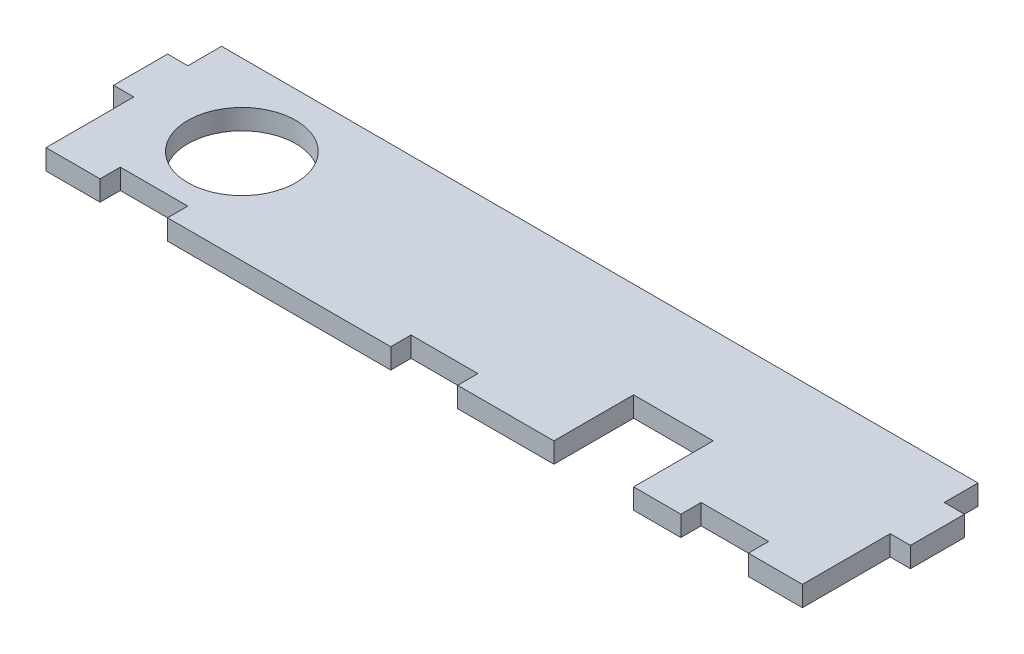
ISO-10303-21;
HEADER;
FILE_DESCRIPTION(('STEP AP214'),'2;1');
FILE_NAME('part.step','',(''),(''),'','','');
FILE_SCHEMA(('AUTOMOTIVE_DESIGN { 1 0 10303 214 1 1 1 1 }'));
ENDSEC;
DATA;
#1=APPLICATION_CONTEXT('core data for automotive mechanical design processes');
#2=APPLICATION_PROTOCOL_DEFINITION('international standard','automotive_design',2000,#1);
#3=PRODUCT_CONTEXT('',#1,'mechanical');
#4=PRODUCT('Part','Part','',(#3));
#5=PRODUCT_RELATED_PRODUCT_CATEGORY('part','',(#4));
#6=PRODUCT_DEFINITION_FORMATION('','',#4);
#7=PRODUCT_DEFINITION_CONTEXT('part definition',#1,'design');
#8=PRODUCT_DEFINITION('design','',#6,#7);
#9=PRODUCT_DEFINITION_SHAPE('','',#8);
#10=(LENGTH_UNIT() NAMED_UNIT(*) SI_UNIT(.MILLI.,.METRE.));
#11=(NAMED_UNIT(*) PLANE_ANGLE_UNIT() SI_UNIT($,.RADIAN.));
#12=(NAMED_UNIT(*) SI_UNIT($,.STERADIAN.) SOLID_ANGLE_UNIT());
#13=UNCERTAINTY_MEASURE_WITH_UNIT(LENGTH_MEASURE(1.E-05),#10,'distance_accuracy_value','');
#14=(GEOMETRIC_REPRESENTATION_CONTEXT(3) GLOBAL_UNCERTAINTY_ASSIGNED_CONTEXT((#13)) GLOBAL_UNIT_ASSIGNED_CONTEXT((#10,
#11,#12)) REPRESENTATION_CONTEXT('',''));
#15=CARTESIAN_POINT('',(0.,0.,0.));
#16=DIRECTION('',(0.,0.,1.));
#17=DIRECTION('',(1.,0.,0.));
#18=AXIS2_PLACEMENT_3D('',#15,#16,#17);
#19=CARTESIAN_POINT('',(0.,3.,0.));
#20=DIRECTION('',(0.,1.,0.));
#21=DIRECTION('',(0.,0.,1.));
#22=AXIS2_PLACEMENT_3D('',#19,#20,#21);
#23=PLANE('',#22);
#24=DIRECTION('',(1.,0.,0.));
#25=VECTOR('',#24,1.);
#26=CARTESIAN_POINT('',(1119.40812578582,3.,2442.39366866363));
#27=LINE('',#26,#25);
#28=CARTESIAN_POINT('',(1109.40812578582,3.,2442.39366866363));
#29=VERTEX_POINT('',#28);
#30=CARTESIAN_POINT('',(1119.40812578582,3.,2442.39366866363));
#31=VERTEX_POINT('',#30);
#32=EDGE_CURVE('E304',#29,#31,#27,.T.);
#33=ORIENTED_EDGE('',*,*,#32,.T.);
#34=DIRECTION('',(0.,0.,1.));
#35=VECTOR('',#34,1.);
#36=CARTESIAN_POINT('',(1119.40812578582,3.,2445.39366866363));
#37=LINE('',#36,#35);
#38=CARTESIAN_POINT('',(1119.40812578582,3.,2445.39366866363));
#39=VERTEX_POINT('',#38);
#40=EDGE_CURVE('E152',#31,#39,#37,.T.);
#41=ORIENTED_EDGE('',*,*,#40,.T.);
#42=DIRECTION('',(1.,0.,0.));
#43=VECTOR('',#42,1.);
#44=CARTESIAN_POINT('',(1119.40812578582,3.,2445.39366866363));
#45=LINE('',#44,#43);
#46=CARTESIAN_POINT('',(1152.45812578582,3.,2445.39366866363));
#47=VERTEX_POINT('',#46);
#48=EDGE_CURVE('E379',#39,#47,#45,.T.);
#49=ORIENTED_EDGE('',*,*,#48,.T.);
#50=DIRECTION('',(0.,0.,-1.));
#51=VECTOR('',#50,1.);
#52=CARTESIAN_POINT('',(1152.45812578582,3.,2445.39366866363));
#53=LINE('',#52,#51);
#54=CARTESIAN_POINT('',(1152.45812578582,3.,2442.39366866363));
#55=VERTEX_POINT('',#54);
#56=EDGE_CURVE('E398',#47,#55,#53,.T.);
#57=ORIENTED_EDGE('',*,*,#56,.T.);
#58=DIRECTION('',(1.,0.,0.));
#59=VECTOR('',#58,1.);
#60=CARTESIAN_POINT('',(1152.45812578582,3.,2442.39366866363));
#61=LINE('',#60,#59);
#62=CARTESIAN_POINT('',(1162.35812578582,3.,2442.39366866363));
#63=VERTEX_POINT('',#62);
#64=EDGE_CURVE('E395',#55,#63,#61,.T.);
#65=ORIENTED_EDGE('',*,*,#64,.T.);
#66=DIRECTION('',(0.,0.,1.));
#67=VECTOR('',#66,1.);
#68=CARTESIAN_POINT('',(1162.35812578582,3.,2442.39366866363));
#69=LINE('',#68,#67);
#70=CARTESIAN_POINT('',(1162.35812578582,3.,2445.39366866363));
#71=VERTEX_POINT('',#70);
#72=EDGE_CURVE('E397',#63,#71,#69,.T.);
#73=ORIENTED_EDGE('',*,*,#72,.T.);
#74=DIRECTION('',(1.,0.,0.));
#75=VECTOR('',#74,1.);
#76=CARTESIAN_POINT('',(1162.35812578582,3.,2445.39366866363));
#77=LINE('',#76,#75);
#78=CARTESIAN_POINT('',(1176.60812578582,3.,2445.39366866363));
#79=VERTEX_POINT('',#78);
#80=EDGE_CURVE('E400',#71,#79,#77,.T.);
#81=ORIENTED_EDGE('',*,*,#80,.T.);
#82=DIRECTION('',(0.,0.,-1.));
#83=VECTOR('',#82,1.);
#84=CARTESIAN_POINT('',(1176.60812578582,3.,2433.59366866363));
#85=LINE('',#84,#83);
#86=CARTESIAN_POINT('',(1176.60812578582,3.,2433.59366866363));
#87=VERTEX_POINT('',#86);
#88=EDGE_CURVE('E406',#79,#87,#85,.T.);
#89=ORIENTED_EDGE('',*,*,#88,.T.);
#90=DIRECTION('',(1.,0.,0.));
#91=VECTOR('',#90,1.);
#92=CARTESIAN_POINT('',(1176.60812578582,3.,2433.59366866363));
#93=LINE('',#92,#91);
#94=CARTESIAN_POINT('',(1188.40812578582,3.,2433.59366866363));
#95=VERTEX_POINT('',#94);
#96=EDGE_CURVE('E408',#87,#95,#93,.T.);
#97=ORIENTED_EDGE('',*,*,#96,.T.);
#98=DIRECTION('',(0.,0.,1.));
#99=VECTOR('',#98,1.);
#100=CARTESIAN_POINT('',(1188.40812578582,3.,2433.59366866363));
#101=LINE('',#100,#99);
#102=CARTESIAN_POINT('',(1188.40812578582,3.,2445.39366866363));
#103=VERTEX_POINT('',#102);
#104=EDGE_CURVE('E410',#95,#103,#101,.T.);
#105=ORIENTED_EDGE('',*,*,#104,.T.);
#106=DIRECTION('',(1.,0.,0.));
#107=VECTOR('',#106,1.);
#108=CARTESIAN_POINT('',(1188.40812578582,3.,2445.39366866363));
#109=LINE('',#108,#107);
#110=CARTESIAN_POINT('',(1195.40812578582,3.,2445.39366866363));
#111=VERTEX_POINT('',#110);
#112=EDGE_CURVE('E412',#103,#111,#109,.T.);
#113=ORIENTED_EDGE('',*,*,#112,.T.);
#114=DIRECTION('',(0.,0.,-1.));
#115=VECTOR('',#114,1.);
#116=CARTESIAN_POINT('',(1195.40812578582,3.,2445.39366866363));
#117=LINE('',#116,#115);
#118=CARTESIAN_POINT('',(1195.40812578582,3.,2442.39366866363));
#119=VERTEX_POINT('',#118);
#120=EDGE_CURVE('E414',#111,#119,#117,.T.);
#121=ORIENTED_EDGE('',*,*,#120,.T.);
#122=DIRECTION('',(1.,0.,0.));
#123=VECTOR('',#122,1.);
#124=CARTESIAN_POINT('',(1195.40812578582,3.,2442.39366866363));
#125=LINE('',#124,#123);
#126=CARTESIAN_POINT('',(1205.40812578582,3.,2442.39366866363));
#127=VERTEX_POINT('',#126);
#128=EDGE_CURVE('E416',#119,#127,#125,.T.);
#129=ORIENTED_EDGE('',*,*,#128,.T.);
#130=DIRECTION('',(0.,0.,1.));
#131=VECTOR('',#130,1.);
#132=CARTESIAN_POINT('',(1205.40812578582,3.,2442.39366866363));
#133=LINE('',#132,#131);
#134=CARTESIAN_POINT('',(1205.40812578582,3.,2445.39366866363));
#135=VERTEX_POINT('',#134);
#136=EDGE_CURVE('E418',#127,#135,#133,.T.);
#137=ORIENTED_EDGE('',*,*,#136,.T.);
#138=DIRECTION('',(1.,0.,0.));
#139=VECTOR('',#138,1.);
#140=CARTESIAN_POINT('',(1205.40812578582,3.,2445.39366866363));
#141=LINE('',#140,#139);
#142=CARTESIAN_POINT('',(1213.40812578582,3.,2445.39366866363));
#143=VERTEX_POINT('',#142);
#144=EDGE_CURVE('E420',#135,#143,#141,.T.);
#145=ORIENTED_EDGE('',*,*,#144,.T.);
#146=DIRECTION('',(0.,0.,-1.));
#147=VECTOR('',#146,1.);
#148=CARTESIAN_POINT('',(1213.40812578582,3.,2432.39366866363));
#149=LINE('',#148,#147);
#150=CARTESIAN_POINT('',(1213.40812578582,3.,2432.39366866363));
#151=VERTEX_POINT('',#150);
#152=EDGE_CURVE('E422',#143,#151,#149,.T.);
#153=ORIENTED_EDGE('',*,*,#152,.T.);
#154=DIRECTION('',(1.,0.,0.));
#155=VECTOR('',#154,1.);
#156=CARTESIAN_POINT('',(1213.40812578582,3.,2432.39366866363));
#157=LINE('',#156,#155);
#158=CARTESIAN_POINT('',(1216.40812578582,3.,2432.39366866363));
#159=VERTEX_POINT('',#158);
#160=EDGE_CURVE('E424',#151,#159,#157,.T.);
#161=ORIENTED_EDGE('',*,*,#160,.T.);
#162=DIRECTION('',(0.,0.,-1.));
#163=VECTOR('',#162,1.);
#164=CARTESIAN_POINT('',(1216.40812578582,3.,2432.39366866363));
#165=LINE('',#164,#163);
#166=CARTESIAN_POINT('',(1216.40812578582,3.,2424.39366866363));
#167=VERTEX_POINT('',#166);
#168=EDGE_CURVE('E426',#159,#167,#165,.T.);
#169=ORIENTED_EDGE('',*,*,#168,.T.);
#170=DIRECTION('',(-1.,0.,0.));
#171=VECTOR('',#170,1.);
#172=CARTESIAN_POINT('',(1216.40812578582,3.,2424.39366866363));
#173=LINE('',#172,#171);
#174=CARTESIAN_POINT('',(1213.40812578582,3.,2424.39366866363));
#175=VERTEX_POINT('',#174);
#176=EDGE_CURVE('E428',#167,#175,#173,.T.);
#177=ORIENTED_EDGE('',*,*,#176,.T.);
#178=DIRECTION('',(0.,0.,-1.));
#179=VECTOR('',#178,1.);
#180=CARTESIAN_POINT('',(1213.40812578582,3.,2419.39366866363));
#181=LINE('',#180,#179);
#182=CARTESIAN_POINT('',(1213.40812578582,3.,2419.39366866363));
#183=VERTEX_POINT('',#182);
#184=EDGE_CURVE('E430',#175,#183,#181,.T.);
#185=ORIENTED_EDGE('',*,*,#184,.T.);
#186=DIRECTION('',(-1.,0.,0.));
#187=VECTOR('',#186,1.);
#188=CARTESIAN_POINT('',(1101.40812578582,3.,2419.39366866363));
#189=LINE('',#188,#187);
#190=CARTESIAN_POINT('',(1101.40812578582,3.,2419.39366866363));
#191=VERTEX_POINT('',#190);
#192=EDGE_CURVE('E432',#183,#191,#189,.T.);
#193=ORIENTED_EDGE('',*,*,#192,.T.);
#194=DIRECTION('',(0.,0.,1.));
#195=VECTOR('',#194,1.);
#196=CARTESIAN_POINT('',(1101.40812578582,3.,2419.39366866363));
#197=LINE('',#196,#195);
#198=CARTESIAN_POINT('',(1101.40812578582,3.,2424.39366866363));
#199=VERTEX_POINT('',#198);
#200=EDGE_CURVE('E434',#191,#199,#197,.T.);
#201=ORIENTED_EDGE('',*,*,#200,.T.);
#202=DIRECTION('',(-1.,0.,0.));
#203=VECTOR('',#202,1.);
#204=CARTESIAN_POINT('',(1098.40812578582,3.,2424.39366866363));
#205=LINE('',#204,#203);
#206=CARTESIAN_POINT('',(1098.40812578582,3.,2424.39366866363));
#207=VERTEX_POINT('',#206);
#208=EDGE_CURVE('E436',#199,#207,#205,.T.);
#209=ORIENTED_EDGE('',*,*,#208,.T.);
#210=DIRECTION('',(0.,0.,1.));
#211=VECTOR('',#210,1.);
#212=CARTESIAN_POINT('',(1098.40812578582,3.,2432.39366866363));
#213=LINE('',#212,#211);
#214=CARTESIAN_POINT('',(1098.40812578582,3.,2432.39366866363));
#215=VERTEX_POINT('',#214);
#216=EDGE_CURVE('E438',#207,#215,#213,.T.);
#217=ORIENTED_EDGE('',*,*,#216,.T.);
#218=DIRECTION('',(1.,0.,0.));
#219=VECTOR('',#218,1.);
#220=CARTESIAN_POINT('',(1101.40812578582,3.,2432.39366866363));
#221=LINE('',#220,#219);
#222=CARTESIAN_POINT('',(1101.40812578582,3.,2432.39366866363));
#223=VERTEX_POINT('',#222);
#224=EDGE_CURVE('E231',#215,#223,#221,.T.);
#225=ORIENTED_EDGE('',*,*,#224,.T.);
#226=DIRECTION('',(0.,0.,1.));
#227=VECTOR('',#226,1.);
#228=CARTESIAN_POINT('',(1101.40812578582,3.,2432.39366866363));
#229=LINE('',#228,#227);
#230=CARTESIAN_POINT('',(1101.40812578582,3.,2445.39366866363));
#231=VERTEX_POINT('',#230);
#232=EDGE_CURVE('E225',#223,#231,#229,.T.);
#233=ORIENTED_EDGE('',*,*,#232,.T.);
#234=DIRECTION('',(1.,0.,0.));
#235=VECTOR('',#234,1.);
#236=CARTESIAN_POINT('',(1109.40812578582,3.,2445.39366866363));
#237=LINE('',#236,#235);
#238=CARTESIAN_POINT('',(1109.40812578582,3.,2445.39366866363));
#239=VERTEX_POINT('',#238);
#240=EDGE_CURVE('E229',#231,#239,#237,.T.);
#241=ORIENTED_EDGE('',*,*,#240,.T.);
#242=DIRECTION('',(0.,0.,-1.));
#243=VECTOR('',#242,1.);
#244=CARTESIAN_POINT('',(1109.40812578582,3.,2442.39366866363));
#245=LINE('',#244,#243);
#246=EDGE_CURVE('E49',#239,#29,#245,.T.);
#247=ORIENTED_EDGE('',*,*,#246,.T.);
#248=EDGE_LOOP('',(#33,#41,#49,#57,#65,#73,#81,#89,#97,#105,#113,#121,#129,#137,#145,#153,#161,
#169,#177,#185,#193,#201,#209,#217,#225,#233,#241,#247));
#249=FACE_BOUND('',#248,.T.);
#250=CARTESIAN_POINT('',(1116.40812578582,3.,2431.39366866363));
#251=DIRECTION('',(0.,1.,0.));
#252=DIRECTION('',(0.,0.,1.));
#253=AXIS2_PLACEMENT_3D('',#250,#251,#252);
#254=CIRCLE('',#253,7.99999999999999);
#255=CARTESIAN_POINT('',(1116.40812578582,3.,2439.39366866363));
#256=VERTEX_POINT('',#255);
#257=EDGE_CURVE('E253',#256,#256,#254,.T.);
#258=ORIENTED_EDGE('',*,*,#257,.F.);
#259=EDGE_LOOP('',(#258));
#260=FACE_BOUND('',#259,.T.);
#261=ADVANCED_FACE('F32',(#249,#260),#23,.T.);
#262=CARTESIAN_POINT('',(0.,0.,0.));
#263=DIRECTION('',(0.,1.,0.));
#264=DIRECTION('',(0.,0.,1.));
#265=AXIS2_PLACEMENT_3D('',#262,#263,#264);
#266=PLANE('',#265);
#267=DIRECTION('',(1.,0.,0.));
#268=VECTOR('',#267,1.);
#269=CARTESIAN_POINT('',(1119.40812578582,0.,2442.39366866363));
#270=LINE('',#269,#268);
#271=CARTESIAN_POINT('',(1109.40812578582,0.,2442.39366866363));
#272=VERTEX_POINT('',#271);
#273=CARTESIAN_POINT('',(1119.40812578582,0.,2442.39366866363));
#274=VERTEX_POINT('',#273);
#275=EDGE_CURVE('E249',#272,#274,#270,.T.);
#276=ORIENTED_EDGE('',*,*,#275,.F.);
#277=DIRECTION('',(0.,0.,-1.));
#278=VECTOR('',#277,1.);
#279=CARTESIAN_POINT('',(1109.40812578582,0.,2442.39366866363));
#280=LINE('',#279,#278);
#281=CARTESIAN_POINT('',(1109.40812578582,0.,2445.39366866363));
#282=VERTEX_POINT('',#281);
#283=EDGE_CURVE('E144',#282,#272,#280,.T.);
#284=ORIENTED_EDGE('',*,*,#283,.F.);
#285=DIRECTION('',(1.,0.,0.));
#286=VECTOR('',#285,1.);
#287=CARTESIAN_POINT('',(1109.40812578582,0.,2445.39366866363));
#288=LINE('',#287,#286);
#289=CARTESIAN_POINT('',(1101.40812578582,0.,2445.39366866363));
#290=VERTEX_POINT('',#289);
#291=EDGE_CURVE('E138',#290,#282,#288,.T.);
#292=ORIENTED_EDGE('',*,*,#291,.F.);
#293=DIRECTION('',(0.,0.,1.));
#294=VECTOR('',#293,1.);
#295=CARTESIAN_POINT('',(1101.40812578582,0.,2432.39366866363));
#296=LINE('',#295,#294);
#297=CARTESIAN_POINT('',(1101.40812578582,0.,2432.39366866363));
#298=VERTEX_POINT('',#297);
#299=EDGE_CURVE('E239',#298,#290,#296,.T.);
#300=ORIENTED_EDGE('',*,*,#299,.F.);
#301=DIRECTION('',(1.,0.,0.));
#302=VECTOR('',#301,1.);
#303=CARTESIAN_POINT('',(1101.40812578582,0.,2432.39366866363));
#304=LINE('',#303,#302);
#305=CARTESIAN_POINT('',(1098.40812578582,0.,2432.39366866363));
#306=VERTEX_POINT('',#305);
#307=EDGE_CURVE('E299',#306,#298,#304,.T.);
#308=ORIENTED_EDGE('',*,*,#307,.F.);
#309=DIRECTION('',(0.,0.,1.));
#310=VECTOR('',#309,1.);
#311=CARTESIAN_POINT('',(1098.40812578582,0.,2432.39366866363));
#312=LINE('',#311,#310);
#313=CARTESIAN_POINT('',(1098.40812578582,0.,2424.39366866363));
#314=VERTEX_POINT('',#313);
#315=EDGE_CURVE('E297',#314,#306,#312,.T.);
#316=ORIENTED_EDGE('',*,*,#315,.F.);
#317=DIRECTION('',(-1.,0.,0.));
#318=VECTOR('',#317,1.);
#319=CARTESIAN_POINT('',(1098.40812578582,0.,2424.39366866363));
#320=LINE('',#319,#318);
#321=CARTESIAN_POINT('',(1101.40812578582,0.,2424.39366866363));
#322=VERTEX_POINT('',#321);
#323=EDGE_CURVE('E295',#322,#314,#320,.T.);
#324=ORIENTED_EDGE('',*,*,#323,.F.);
#325=DIRECTION('',(0.,0.,1.));
#326=VECTOR('',#325,1.);
#327=CARTESIAN_POINT('',(1101.40812578582,0.,2419.39366866363));
#328=LINE('',#327,#326);
#329=CARTESIAN_POINT('',(1101.40812578582,0.,2419.39366866363));
#330=VERTEX_POINT('',#329);
#331=EDGE_CURVE('E293',#330,#322,#328,.T.);
#332=ORIENTED_EDGE('',*,*,#331,.F.);
#333=DIRECTION('',(-1.,0.,0.));
#334=VECTOR('',#333,1.);
#335=CARTESIAN_POINT('',(1101.40812578582,0.,2419.39366866363));
#336=LINE('',#335,#334);
#337=CARTESIAN_POINT('',(1213.40812578582,0.,2419.39366866363));
#338=VERTEX_POINT('',#337);
#339=EDGE_CURVE('E291',#338,#330,#336,.T.);
#340=ORIENTED_EDGE('',*,*,#339,.F.);
#341=DIRECTION('',(0.,0.,-1.));
#342=VECTOR('',#341,1.);
#343=CARTESIAN_POINT('',(1213.40812578582,0.,2419.39366866363));
#344=LINE('',#343,#342);
#345=CARTESIAN_POINT('',(1213.40812578582,0.,2424.39366866363));
#346=VERTEX_POINT('',#345);
#347=EDGE_CURVE('E289',#346,#338,#344,.T.);
#348=ORIENTED_EDGE('',*,*,#347,.F.);
#349=DIRECTION('',(-1.,0.,0.));
#350=VECTOR('',#349,1.);
#351=CARTESIAN_POINT('',(1216.40812578582,0.,2424.39366866363));
#352=LINE('',#351,#350);
#353=CARTESIAN_POINT('',(1216.40812578582,0.,2424.39366866363));
#354=VERTEX_POINT('',#353);
#355=EDGE_CURVE('E287',#354,#346,#352,.T.);
#356=ORIENTED_EDGE('',*,*,#355,.F.);
#357=DIRECTION('',(0.,0.,-1.));
#358=VECTOR('',#357,1.);
#359=CARTESIAN_POINT('',(1216.40812578582,0.,2432.39366866363));
#360=LINE('',#359,#358);
#361=CARTESIAN_POINT('',(1216.40812578582,0.,2432.39366866363));
#362=VERTEX_POINT('',#361);
#363=EDGE_CURVE('E285',#362,#354,#360,.T.);
#364=ORIENTED_EDGE('',*,*,#363,.F.);
#365=DIRECTION('',(1.,0.,0.));
#366=VECTOR('',#365,1.);
#367=CARTESIAN_POINT('',(1213.40812578582,0.,2432.39366866363));
#368=LINE('',#367,#366);
#369=CARTESIAN_POINT('',(1213.40812578582,0.,2432.39366866363));
#370=VERTEX_POINT('',#369);
#371=EDGE_CURVE('E283',#370,#362,#368,.T.);
#372=ORIENTED_EDGE('',*,*,#371,.F.);
#373=DIRECTION('',(0.,0.,-1.));
#374=VECTOR('',#373,1.);
#375=CARTESIAN_POINT('',(1213.40812578582,0.,2432.39366866363));
#376=LINE('',#375,#374);
#377=CARTESIAN_POINT('',(1213.40812578582,0.,2445.39366866363));
#378=VERTEX_POINT('',#377);
#379=EDGE_CURVE('E281',#378,#370,#376,.T.);
#380=ORIENTED_EDGE('',*,*,#379,.F.);
#381=DIRECTION('',(1.,0.,0.));
#382=VECTOR('',#381,1.);
#383=CARTESIAN_POINT('',(1205.40812578582,0.,2445.39366866363));
#384=LINE('',#383,#382);
#385=CARTESIAN_POINT('',(1205.40812578582,0.,2445.39366866363));
#386=VERTEX_POINT('',#385);
#387=EDGE_CURVE('E279',#386,#378,#384,.T.);
#388=ORIENTED_EDGE('',*,*,#387,.F.);
#389=DIRECTION('',(0.,0.,1.));
#390=VECTOR('',#389,1.);
#391=CARTESIAN_POINT('',(1205.40812578582,0.,2442.39366866363));
#392=LINE('',#391,#390);
#393=CARTESIAN_POINT('',(1205.40812578582,0.,2442.39366866363));
#394=VERTEX_POINT('',#393);
#395=EDGE_CURVE('E277',#394,#386,#392,.T.);
#396=ORIENTED_EDGE('',*,*,#395,.F.);
#397=DIRECTION('',(1.,0.,0.));
#398=VECTOR('',#397,1.);
#399=CARTESIAN_POINT('',(1195.40812578582,0.,2442.39366866363));
#400=LINE('',#399,#398);
#401=CARTESIAN_POINT('',(1195.40812578582,0.,2442.39366866363));
#402=VERTEX_POINT('',#401);
#403=EDGE_CURVE('E275',#402,#394,#400,.T.);
#404=ORIENTED_EDGE('',*,*,#403,.F.);
#405=DIRECTION('',(0.,0.,-1.));
#406=VECTOR('',#405,1.);
#407=CARTESIAN_POINT('',(1195.40812578582,0.,2445.39366866363));
#408=LINE('',#407,#406);
#409=CARTESIAN_POINT('',(1195.40812578582,0.,2445.39366866363));
#410=VERTEX_POINT('',#409);
#411=EDGE_CURVE('E273',#410,#402,#408,.T.);
#412=ORIENTED_EDGE('',*,*,#411,.F.);
#413=DIRECTION('',(1.,0.,0.));
#414=VECTOR('',#413,1.);
#415=CARTESIAN_POINT('',(1188.40812578582,0.,2445.39366866363));
#416=LINE('',#415,#414);
#417=CARTESIAN_POINT('',(1188.40812578582,0.,2445.39366866363));
#418=VERTEX_POINT('',#417);
#419=EDGE_CURVE('E271',#418,#410,#416,.T.);
#420=ORIENTED_EDGE('',*,*,#419,.F.);
#421=DIRECTION('',(0.,0.,1.));
#422=VECTOR('',#421,1.);
#423=CARTESIAN_POINT('',(1188.40812578582,0.,2433.59366866363));
#424=LINE('',#423,#422);
#425=CARTESIAN_POINT('',(1188.40812578582,0.,2433.59366866363));
#426=VERTEX_POINT('',#425);
#427=EDGE_CURVE('E269',#426,#418,#424,.T.);
#428=ORIENTED_EDGE('',*,*,#427,.F.);
#429=DIRECTION('',(1.,0.,0.));
#430=VECTOR('',#429,1.);
#431=CARTESIAN_POINT('',(1176.60812578582,0.,2433.59366866363));
#432=LINE('',#431,#430);
#433=CARTESIAN_POINT('',(1176.60812578582,0.,2433.59366866363));
#434=VERTEX_POINT('',#433);
#435=EDGE_CURVE('E267',#434,#426,#432,.T.);
#436=ORIENTED_EDGE('',*,*,#435,.F.);
#437=DIRECTION('',(0.,0.,-1.));
#438=VECTOR('',#437,1.);
#439=CARTESIAN_POINT('',(1176.60812578582,0.,2433.59366866363));
#440=LINE('',#439,#438);
#441=CARTESIAN_POINT('',(1176.60812578582,0.,2445.39366866363));
#442=VERTEX_POINT('',#441);
#443=EDGE_CURVE('E265',#442,#434,#440,.T.);
#444=ORIENTED_EDGE('',*,*,#443,.F.);
#445=DIRECTION('',(1.,0.,0.));
#446=VECTOR('',#445,1.);
#447=CARTESIAN_POINT('',(1162.35812578582,0.,2445.39366866363));
#448=LINE('',#447,#446);
#449=CARTESIAN_POINT('',(1162.35812578582,0.,2445.39366866363));
#450=VERTEX_POINT('',#449);
#451=EDGE_CURVE('E263',#450,#442,#448,.T.);
#452=ORIENTED_EDGE('',*,*,#451,.F.);
#453=DIRECTION('',(0.,0.,1.));
#454=VECTOR('',#453,1.);
#455=CARTESIAN_POINT('',(1162.35812578582,0.,2442.39366866363));
#456=LINE('',#455,#454);
#457=CARTESIAN_POINT('',(1162.35812578582,0.,2442.39366866363));
#458=VERTEX_POINT('',#457);
#459=EDGE_CURVE('E261',#458,#450,#456,.T.);
#460=ORIENTED_EDGE('',*,*,#459,.F.);
#461=DIRECTION('',(1.,0.,0.));
#462=VECTOR('',#461,1.);
#463=CARTESIAN_POINT('',(1152.45812578582,0.,2442.39366866363));
#464=LINE('',#463,#462);
#465=CARTESIAN_POINT('',(1152.45812578582,0.,2442.39366866363));
#466=VERTEX_POINT('',#465);
#467=EDGE_CURVE('E259',#466,#458,#464,.T.);
#468=ORIENTED_EDGE('',*,*,#467,.F.);
#469=DIRECTION('',(0.,0.,-1.));
#470=VECTOR('',#469,1.);
#471=CARTESIAN_POINT('',(1152.45812578582,0.,2445.39366866363));
#472=LINE('',#471,#470);
#473=CARTESIAN_POINT('',(1152.45812578582,0.,2445.39366866363));
#474=VERTEX_POINT('',#473);
#475=EDGE_CURVE('E257',#474,#466,#472,.T.);
#476=ORIENTED_EDGE('',*,*,#475,.F.);
#477=DIRECTION('',(1.,0.,0.));
#478=VECTOR('',#477,1.);
#479=CARTESIAN_POINT('',(1119.40812578582,0.,2445.39366866363));
#480=LINE('',#479,#478);
#481=CARTESIAN_POINT('',(1119.40812578582,0.,2445.39366866363));
#482=VERTEX_POINT('',#481);
#483=EDGE_CURVE('E255',#482,#474,#480,.T.);
#484=ORIENTED_EDGE('',*,*,#483,.F.);
#485=DIRECTION('',(0.,0.,1.));
#486=VECTOR('',#485,1.);
#487=CARTESIAN_POINT('',(1119.40812578582,0.,2445.39366866363));
#488=LINE('',#487,#486);
#489=EDGE_CURVE('E252',#274,#482,#488,.T.);
#490=ORIENTED_EDGE('',*,*,#489,.F.);
#491=EDGE_LOOP('',(#276,#284,#292,#300,#308,#316,#324,#332,#340,#348,#356,#364,#372,#380,#388,
#396,#404,#412,#420,#428,#436,#444,#452,#460,#468,#476,#484,#490));
#492=FACE_BOUND('',#491,.T.);
#493=CARTESIAN_POINT('',(1116.40812578582,0.,2431.39366866363));
#494=DIRECTION('',(0.,1.,0.));
#495=DIRECTION('',(0.,0.,1.));
#496=AXIS2_PLACEMENT_3D('',#493,#494,#495);
#497=CIRCLE('',#496,7.99999999999999);
#498=CARTESIAN_POINT('',(1116.40812578582,0.,2439.39366866363));
#499=VERTEX_POINT('',#498);
#500=EDGE_CURVE('E793',#499,#499,#497,.T.);
#501=ORIENTED_EDGE('',*,*,#500,.T.);
#502=EDGE_LOOP('',(#501));
#503=FACE_BOUND('',#502,.T.);
#504=ADVANCED_FACE('F383',(#492,#503),#266,.F.);
#505=CARTESIAN_POINT('',(1119.40812578582,3.,2442.39366866363));
#506=DIRECTION('',(0.,0.,-1.));
#507=DIRECTION('',(-1.,0.,0.));
#508=AXIS2_PLACEMENT_3D('',#505,#506,#507);
#509=PLANE('',#508);
#510=ORIENTED_EDGE('',*,*,#275,.T.);
#511=DIRECTION('',(0.,-1.,0.));
#512=VECTOR('',#511,1.);
#513=CARTESIAN_POINT('',(1119.40812578582,3.,2442.39366866363));
#514=LINE('',#513,#512);
#515=EDGE_CURVE('E11',#31,#274,#514,.T.);
#516=ORIENTED_EDGE('',*,*,#515,.F.);
#517=ORIENTED_EDGE('',*,*,#32,.F.);
#518=DIRECTION('',(0.,-1.,0.));
#519=VECTOR('',#518,1.);
#520=CARTESIAN_POINT('',(1109.40812578582,3.,2442.39366866363));
#521=LINE('',#520,#519);
#522=EDGE_CURVE('E245',#29,#272,#521,.T.);
#523=ORIENTED_EDGE('',*,*,#522,.T.);
#524=EDGE_LOOP('',(#510,#516,#517,#523));
#525=FACE_BOUND('',#524,.T.);
#526=ADVANCED_FACE('F34',(#525),#509,.F.);
#527=CARTESIAN_POINT('',(1119.40812578582,3.,2445.39366866363));
#528=DIRECTION('',(1.,0.,0.));
#529=DIRECTION('',(0.,0.,-1.));
#530=AXIS2_PLACEMENT_3D('',#527,#528,#529);
#531=PLANE('',#530);
#532=ORIENTED_EDGE('',*,*,#489,.T.);
#533=DIRECTION('',(0.,-1.,0.));
#534=VECTOR('',#533,1.);
#535=CARTESIAN_POINT('',(1119.40812578582,3.,2445.39366866363));
#536=LINE('',#535,#534);
#537=EDGE_CURVE('E41',#39,#482,#536,.T.);
#538=ORIENTED_EDGE('',*,*,#537,.F.);
#539=ORIENTED_EDGE('',*,*,#40,.F.);
#540=ORIENTED_EDGE('',*,*,#515,.T.);
#541=EDGE_LOOP('',(#532,#538,#539,#540));
#542=FACE_BOUND('',#541,.T.);
#543=ADVANCED_FACE('F472',(#542),#531,.F.);
#544=CARTESIAN_POINT('',(1119.40812578582,3.,2445.39366866363));
#545=DIRECTION('',(0.,0.,-1.));
#546=DIRECTION('',(-1.,0.,0.));
#547=AXIS2_PLACEMENT_3D('',#544,#545,#546);
#548=PLANE('',#547);
#549=ORIENTED_EDGE('',*,*,#483,.T.);
#550=DIRECTION('',(0.,-1.,0.));
#551=VECTOR('',#550,1.);
#552=CARTESIAN_POINT('',(1152.45812578582,3.,2445.39366866363));
#553=LINE('',#552,#551);
#554=EDGE_CURVE('E371',#47,#474,#553,.T.);
#555=ORIENTED_EDGE('',*,*,#554,.F.);
#556=ORIENTED_EDGE('',*,*,#48,.F.);
#557=ORIENTED_EDGE('',*,*,#537,.T.);
#558=EDGE_LOOP('',(#549,#555,#556,#557));
#559=FACE_BOUND('',#558,.T.);
#560=ADVANCED_FACE('F377',(#559),#548,.F.);
#561=CARTESIAN_POINT('',(1152.45812578582,3.,2445.39366866363));
#562=DIRECTION('',(-1.,0.,0.));
#563=DIRECTION('',(0.,0.,1.));
#564=AXIS2_PLACEMENT_3D('',#561,#562,#563);
#565=PLANE('',#564);
#566=ORIENTED_EDGE('',*,*,#475,.T.);
#567=DIRECTION('',(0.,-1.,0.));
#568=VECTOR('',#567,1.);
#569=CARTESIAN_POINT('',(1152.45812578582,3.,2442.39366866363));
#570=LINE('',#569,#568);
#571=EDGE_CURVE('E368',#55,#466,#570,.T.);
#572=ORIENTED_EDGE('',*,*,#571,.F.);
#573=ORIENTED_EDGE('',*,*,#56,.F.);
#574=ORIENTED_EDGE('',*,*,#554,.T.);
#575=EDGE_LOOP('',(#566,#572,#573,#574));
#576=FACE_BOUND('',#575,.T.);
#577=ADVANCED_FACE('F389',(#576),#565,.F.);
#578=CARTESIAN_POINT('',(1152.45812578582,3.,2442.39366866363));
#579=DIRECTION('',(0.,0.,-1.));
#580=DIRECTION('',(-1.,0.,0.));
#581=AXIS2_PLACEMENT_3D('',#578,#579,#580);
#582=PLANE('',#581);
#583=ORIENTED_EDGE('',*,*,#467,.T.);
#584=DIRECTION('',(0.,-1.,0.));
#585=VECTOR('',#584,1.);
#586=CARTESIAN_POINT('',(1162.35812578582,3.,2442.39366866363));
#587=LINE('',#586,#585);
#588=EDGE_CURVE('E365',#63,#458,#587,.T.);
#589=ORIENTED_EDGE('',*,*,#588,.F.);
#590=ORIENTED_EDGE('',*,*,#64,.F.);
#591=ORIENTED_EDGE('',*,*,#571,.T.);
#592=EDGE_LOOP('',(#583,#589,#590,#591));
#593=FACE_BOUND('',#592,.T.);
#594=ADVANCED_FACE('F393',(#593),#582,.F.);
#595=CARTESIAN_POINT('',(1162.35812578582,3.,2442.39366866363));
#596=DIRECTION('',(1.,0.,0.));
#597=DIRECTION('',(0.,0.,-1.));
#598=AXIS2_PLACEMENT_3D('',#595,#596,#597);
#599=PLANE('',#598);
#600=ORIENTED_EDGE('',*,*,#459,.T.);
#601=DIRECTION('',(0.,-1.,0.));
#602=VECTOR('',#601,1.);
#603=CARTESIAN_POINT('',(1162.35812578582,3.,2445.39366866363));
#604=LINE('',#603,#602);
#605=EDGE_CURVE('E362',#71,#450,#604,.T.);
#606=ORIENTED_EDGE('',*,*,#605,.F.);
#607=ORIENTED_EDGE('',*,*,#72,.F.);
#608=ORIENTED_EDGE('',*,*,#588,.T.);
#609=EDGE_LOOP('',(#600,#606,#607,#608));
#610=FACE_BOUND('',#609,.T.);
#611=ADVANCED_FACE('F485',(#610),#599,.F.);
#612=CARTESIAN_POINT('',(1162.35812578582,3.,2445.39366866363));
#613=DIRECTION('',(0.,0.,-1.));
#614=DIRECTION('',(-1.,0.,0.));
#615=AXIS2_PLACEMENT_3D('',#612,#613,#614);
#616=PLANE('',#615);
#617=ORIENTED_EDGE('',*,*,#451,.T.);
#618=DIRECTION('',(0.,-1.,0.));
#619=VECTOR('',#618,1.);
#620=CARTESIAN_POINT('',(1176.60812578582,3.,2445.39366866363));
#621=LINE('',#620,#619);
#622=EDGE_CURVE('E359',#79,#442,#621,.T.);
#623=ORIENTED_EDGE('',*,*,#622,.F.);
#624=ORIENTED_EDGE('',*,*,#80,.F.);
#625=ORIENTED_EDGE('',*,*,#605,.T.);
#626=EDGE_LOOP('',(#617,#623,#624,#625));
#627=FACE_BOUND('',#626,.T.);
#628=ADVANCED_FACE('F488',(#627),#616,.F.);
#629=CARTESIAN_POINT('',(1176.60812578582,3.,2433.59366866363));
#630=DIRECTION('',(-1.,0.,0.));
#631=DIRECTION('',(0.,0.,1.));
#632=AXIS2_PLACEMENT_3D('',#629,#630,#631);
#633=PLANE('',#632);
#634=ORIENTED_EDGE('',*,*,#443,.T.);
#635=DIRECTION('',(0.,-1.,0.));
#636=VECTOR('',#635,1.);
#637=CARTESIAN_POINT('',(1176.60812578582,3.,2433.59366866363));
#638=LINE('',#637,#636);
#639=EDGE_CURVE('E356',#87,#434,#638,.T.);
#640=ORIENTED_EDGE('',*,*,#639,.F.);
#641=ORIENTED_EDGE('',*,*,#88,.F.);
#642=ORIENTED_EDGE('',*,*,#622,.T.);
#643=EDGE_LOOP('',(#634,#640,#641,#642));
#644=FACE_BOUND('',#643,.T.);
#645=ADVANCED_FACE('F492',(#644),#633,.F.);
#646=CARTESIAN_POINT('',(1176.60812578582,3.,2433.59366866363));
#647=DIRECTION('',(0.,0.,-1.));
#648=DIRECTION('',(-1.,0.,0.));
#649=AXIS2_PLACEMENT_3D('',#646,#647,#648);
#650=PLANE('',#649);
#651=ORIENTED_EDGE('',*,*,#435,.T.);
#652=DIRECTION('',(0.,-1.,0.));
#653=VECTOR('',#652,1.);
#654=CARTESIAN_POINT('',(1188.40812578582,3.,2433.59366866363));
#655=LINE('',#654,#653);
#656=EDGE_CURVE('E353',#95,#426,#655,.T.);
#657=ORIENTED_EDGE('',*,*,#656,.F.);
#658=ORIENTED_EDGE('',*,*,#96,.F.);
#659=ORIENTED_EDGE('',*,*,#639,.T.);
#660=EDGE_LOOP('',(#651,#657,#658,#659));
#661=FACE_BOUND('',#660,.T.);
#662=ADVANCED_FACE('F496',(#661),#650,.F.);
#663=CARTESIAN_POINT('',(1188.40812578582,3.,2433.59366866363));
#664=DIRECTION('',(1.,0.,0.));
#665=DIRECTION('',(0.,0.,-1.));
#666=AXIS2_PLACEMENT_3D('',#663,#664,#665);
#667=PLANE('',#666);
#668=ORIENTED_EDGE('',*,*,#427,.T.);
#669=DIRECTION('',(0.,-1.,0.));
#670=VECTOR('',#669,1.);
#671=CARTESIAN_POINT('',(1188.40812578582,3.,2445.39366866363));
#672=LINE('',#671,#670);
#673=EDGE_CURVE('E350',#103,#418,#672,.T.);
#674=ORIENTED_EDGE('',*,*,#673,.F.);
#675=ORIENTED_EDGE('',*,*,#104,.F.);
#676=ORIENTED_EDGE('',*,*,#656,.T.);
#677=EDGE_LOOP('',(#668,#674,#675,#676));
#678=FACE_BOUND('',#677,.T.);
#679=ADVANCED_FACE('F500',(#678),#667,.F.);
#680=CARTESIAN_POINT('',(1188.40812578582,3.,2445.39366866363));
#681=DIRECTION('',(0.,0.,-1.));
#682=DIRECTION('',(-1.,0.,0.));
#683=AXIS2_PLACEMENT_3D('',#680,#681,#682);
#684=PLANE('',#683);
#685=ORIENTED_EDGE('',*,*,#419,.T.);
#686=DIRECTION('',(0.,-1.,0.));
#687=VECTOR('',#686,1.);
#688=CARTESIAN_POINT('',(1195.40812578582,3.,2445.39366866363));
#689=LINE('',#688,#687);
#690=EDGE_CURVE('E347',#111,#410,#689,.T.);
#691=ORIENTED_EDGE('',*,*,#690,.F.);
#692=ORIENTED_EDGE('',*,*,#112,.F.);
#693=ORIENTED_EDGE('',*,*,#673,.T.);
#694=EDGE_LOOP('',(#685,#691,#692,#693));
#695=FACE_BOUND('',#694,.T.);
#696=ADVANCED_FACE('F504',(#695),#684,.F.);
#697=CARTESIAN_POINT('',(1195.40812578582,3.,2445.39366866363));
#698=DIRECTION('',(-1.,0.,0.));
#699=DIRECTION('',(0.,0.,1.));
#700=AXIS2_PLACEMENT_3D('',#697,#698,#699);
#701=PLANE('',#700);
#702=ORIENTED_EDGE('',*,*,#411,.T.);
#703=DIRECTION('',(0.,-1.,0.));
#704=VECTOR('',#703,1.);
#705=CARTESIAN_POINT('',(1195.40812578582,3.,2442.39366866363));
#706=LINE('',#705,#704);
#707=EDGE_CURVE('E344',#119,#402,#706,.T.);
#708=ORIENTED_EDGE('',*,*,#707,.F.);
#709=ORIENTED_EDGE('',*,*,#120,.F.);
#710=ORIENTED_EDGE('',*,*,#690,.T.);
#711=EDGE_LOOP('',(#702,#708,#709,#710));
#712=FACE_BOUND('',#711,.T.);
#713=ADVANCED_FACE('F508',(#712),#701,.F.);
#714=CARTESIAN_POINT('',(1195.40812578582,3.,2442.39366866363));
#715=DIRECTION('',(0.,0.,-1.));
#716=DIRECTION('',(-1.,0.,0.));
#717=AXIS2_PLACEMENT_3D('',#714,#715,#716);
#718=PLANE('',#717);
#719=ORIENTED_EDGE('',*,*,#403,.T.);
#720=DIRECTION('',(0.,-1.,0.));
#721=VECTOR('',#720,1.);
#722=CARTESIAN_POINT('',(1205.40812578582,3.,2442.39366866363));
#723=LINE('',#722,#721);
#724=EDGE_CURVE('E341',#127,#394,#723,.T.);
#725=ORIENTED_EDGE('',*,*,#724,.F.);
#726=ORIENTED_EDGE('',*,*,#128,.F.);
#727=ORIENTED_EDGE('',*,*,#707,.T.);
#728=EDGE_LOOP('',(#719,#725,#726,#727));
#729=FACE_BOUND('',#728,.T.);
#730=ADVANCED_FACE('F512',(#729),#718,.F.);
#731=CARTESIAN_POINT('',(1205.40812578582,3.,2442.39366866363));
#732=DIRECTION('',(1.,0.,0.));
#733=DIRECTION('',(0.,0.,-1.));
#734=AXIS2_PLACEMENT_3D('',#731,#732,#733);
#735=PLANE('',#734);
#736=ORIENTED_EDGE('',*,*,#395,.T.);
#737=DIRECTION('',(0.,-1.,0.));
#738=VECTOR('',#737,1.);
#739=CARTESIAN_POINT('',(1205.40812578582,3.,2445.39366866363));
#740=LINE('',#739,#738);
#741=EDGE_CURVE('E338',#135,#386,#740,.T.);
#742=ORIENTED_EDGE('',*,*,#741,.F.);
#743=ORIENTED_EDGE('',*,*,#136,.F.);
#744=ORIENTED_EDGE('',*,*,#724,.T.);
#745=EDGE_LOOP('',(#736,#742,#743,#744));
#746=FACE_BOUND('',#745,.T.);
#747=ADVANCED_FACE('F516',(#746),#735,.F.);
#748=CARTESIAN_POINT('',(1205.40812578582,3.,2445.39366866363));
#749=DIRECTION('',(0.,0.,-1.));
#750=DIRECTION('',(-1.,0.,0.));
#751=AXIS2_PLACEMENT_3D('',#748,#749,#750);
#752=PLANE('',#751);
#753=ORIENTED_EDGE('',*,*,#387,.T.);
#754=DIRECTION('',(0.,-1.,0.));
#755=VECTOR('',#754,1.);
#756=CARTESIAN_POINT('',(1213.40812578582,3.,2445.39366866363));
#757=LINE('',#756,#755);
#758=EDGE_CURVE('E335',#143,#378,#757,.T.);
#759=ORIENTED_EDGE('',*,*,#758,.F.);
#760=ORIENTED_EDGE('',*,*,#144,.F.);
#761=ORIENTED_EDGE('',*,*,#741,.T.);
#762=EDGE_LOOP('',(#753,#759,#760,#761));
#763=FACE_BOUND('',#762,.T.);
#764=ADVANCED_FACE('F520',(#763),#752,.F.);
#765=CARTESIAN_POINT('',(1213.40812578582,3.,2432.39366866363));
#766=DIRECTION('',(-1.,0.,0.));
#767=DIRECTION('',(0.,0.,1.));
#768=AXIS2_PLACEMENT_3D('',#765,#766,#767);
#769=PLANE('',#768);
#770=ORIENTED_EDGE('',*,*,#379,.T.);
#771=DIRECTION('',(0.,-1.,0.));
#772=VECTOR('',#771,1.);
#773=CARTESIAN_POINT('',(1213.40812578582,3.,2432.39366866363));
#774=LINE('',#773,#772);
#775=EDGE_CURVE('E332',#151,#370,#774,.T.);
#776=ORIENTED_EDGE('',*,*,#775,.F.);
#777=ORIENTED_EDGE('',*,*,#152,.F.);
#778=ORIENTED_EDGE('',*,*,#758,.T.);
#779=EDGE_LOOP('',(#770,#776,#777,#778));
#780=FACE_BOUND('',#779,.T.);
#781=ADVANCED_FACE('F524',(#780),#769,.F.);
#782=CARTESIAN_POINT('',(1213.40812578582,3.,2432.39366866363));
#783=DIRECTION('',(0.,0.,-1.));
#784=DIRECTION('',(-1.,0.,0.));
#785=AXIS2_PLACEMENT_3D('',#782,#783,#784);
#786=PLANE('',#785);
#787=ORIENTED_EDGE('',*,*,#371,.T.);
#788=DIRECTION('',(0.,-1.,0.));
#789=VECTOR('',#788,1.);
#790=CARTESIAN_POINT('',(1216.40812578582,3.,2432.39366866363));
#791=LINE('',#790,#789);
#792=EDGE_CURVE('E329',#159,#362,#791,.T.);
#793=ORIENTED_EDGE('',*,*,#792,.F.);
#794=ORIENTED_EDGE('',*,*,#160,.F.);
#795=ORIENTED_EDGE('',*,*,#775,.T.);
#796=EDGE_LOOP('',(#787,#793,#794,#795));
#797=FACE_BOUND('',#796,.T.);
#798=ADVANCED_FACE('F528',(#797),#786,.F.);
#799=CARTESIAN_POINT('',(1216.40812578582,3.,2432.39366866363));
#800=DIRECTION('',(-1.,0.,0.));
#801=DIRECTION('',(0.,0.,1.));
#802=AXIS2_PLACEMENT_3D('',#799,#800,#801);
#803=PLANE('',#802);
#804=ORIENTED_EDGE('',*,*,#363,.T.);
#805=DIRECTION('',(0.,-1.,0.));
#806=VECTOR('',#805,1.);
#807=CARTESIAN_POINT('',(1216.40812578582,3.,2424.39366866363));
#808=LINE('',#807,#806);
#809=EDGE_CURVE('E326',#167,#354,#808,.T.);
#810=ORIENTED_EDGE('',*,*,#809,.F.);
#811=ORIENTED_EDGE('',*,*,#168,.F.);
#812=ORIENTED_EDGE('',*,*,#792,.T.);
#813=EDGE_LOOP('',(#804,#810,#811,#812));
#814=FACE_BOUND('',#813,.T.);
#815=ADVANCED_FACE('F532',(#814),#803,.F.);
#816=CARTESIAN_POINT('',(1216.40812578582,3.,2424.39366866363));
#817=DIRECTION('',(0.,0.,1.));
#818=DIRECTION('',(1.,0.,0.));
#819=AXIS2_PLACEMENT_3D('',#816,#817,#818);
#820=PLANE('',#819);
#821=ORIENTED_EDGE('',*,*,#355,.T.);
#822=DIRECTION('',(0.,-1.,0.));
#823=VECTOR('',#822,1.);
#824=CARTESIAN_POINT('',(1213.40812578582,3.,2424.39366866363));
#825=LINE('',#824,#823);
#826=EDGE_CURVE('E323',#175,#346,#825,.T.);
#827=ORIENTED_EDGE('',*,*,#826,.F.);
#828=ORIENTED_EDGE('',*,*,#176,.F.);
#829=ORIENTED_EDGE('',*,*,#809,.T.);
#830=EDGE_LOOP('',(#821,#827,#828,#829));
#831=FACE_BOUND('',#830,.T.);
#832=ADVANCED_FACE('F536',(#831),#820,.F.);
#833=CARTESIAN_POINT('',(1213.40812578582,3.,2419.39366866363));
#834=DIRECTION('',(-1.,0.,0.));
#835=DIRECTION('',(0.,0.,1.));
#836=AXIS2_PLACEMENT_3D('',#833,#834,#835);
#837=PLANE('',#836);
#838=ORIENTED_EDGE('',*,*,#347,.T.);
#839=DIRECTION('',(0.,-1.,0.));
#840=VECTOR('',#839,1.);
#841=CARTESIAN_POINT('',(1213.40812578582,3.,2419.39366866363));
#842=LINE('',#841,#840);
#843=EDGE_CURVE('E320',#183,#338,#842,.T.);
#844=ORIENTED_EDGE('',*,*,#843,.F.);
#845=ORIENTED_EDGE('',*,*,#184,.F.);
#846=ORIENTED_EDGE('',*,*,#826,.T.);
#847=EDGE_LOOP('',(#838,#844,#845,#846));
#848=FACE_BOUND('',#847,.T.);
#849=ADVANCED_FACE('F540',(#848),#837,.F.);
#850=CARTESIAN_POINT('',(1101.40812578582,3.,2419.39366866363));
#851=DIRECTION('',(0.,0.,1.));
#852=DIRECTION('',(1.,0.,0.));
#853=AXIS2_PLACEMENT_3D('',#850,#851,#852);
#854=PLANE('',#853);
#855=ORIENTED_EDGE('',*,*,#339,.T.);
#856=DIRECTION('',(0.,-1.,0.));
#857=VECTOR('',#856,1.);
#858=CARTESIAN_POINT('',(1101.40812578582,3.,2419.39366866363));
#859=LINE('',#858,#857);
#860=EDGE_CURVE('E317',#191,#330,#859,.T.);
#861=ORIENTED_EDGE('',*,*,#860,.F.);
#862=ORIENTED_EDGE('',*,*,#192,.F.);
#863=ORIENTED_EDGE('',*,*,#843,.T.);
#864=EDGE_LOOP('',(#855,#861,#862,#863));
#865=FACE_BOUND('',#864,.T.);
#866=ADVANCED_FACE('F544',(#865),#854,.F.);
#867=CARTESIAN_POINT('',(1101.40812578582,3.,2419.39366866363));
#868=DIRECTION('',(1.,0.,0.));
#869=DIRECTION('',(0.,0.,-1.));
#870=AXIS2_PLACEMENT_3D('',#867,#868,#869);
#871=PLANE('',#870);
#872=ORIENTED_EDGE('',*,*,#331,.T.);
#873=DIRECTION('',(0.,-1.,0.));
#874=VECTOR('',#873,1.);
#875=CARTESIAN_POINT('',(1101.40812578582,3.,2424.39366866363));
#876=LINE('',#875,#874);
#877=EDGE_CURVE('E314',#199,#322,#876,.T.);
#878=ORIENTED_EDGE('',*,*,#877,.F.);
#879=ORIENTED_EDGE('',*,*,#200,.F.);
#880=ORIENTED_EDGE('',*,*,#860,.T.);
#881=EDGE_LOOP('',(#872,#878,#879,#880));
#882=FACE_BOUND('',#881,.T.);
#883=ADVANCED_FACE('F548',(#882),#871,.F.);
#884=CARTESIAN_POINT('',(1098.40812578582,3.,2424.39366866363));
#885=DIRECTION('',(0.,0.,1.));
#886=DIRECTION('',(1.,0.,0.));
#887=AXIS2_PLACEMENT_3D('',#884,#885,#886);
#888=PLANE('',#887);
#889=ORIENTED_EDGE('',*,*,#323,.T.);
#890=DIRECTION('',(0.,-1.,0.));
#891=VECTOR('',#890,1.);
#892=CARTESIAN_POINT('',(1098.40812578582,3.,2424.39366866363));
#893=LINE('',#892,#891);
#894=EDGE_CURVE('E311',#207,#314,#893,.T.);
#895=ORIENTED_EDGE('',*,*,#894,.F.);
#896=ORIENTED_EDGE('',*,*,#208,.F.);
#897=ORIENTED_EDGE('',*,*,#877,.T.);
#898=EDGE_LOOP('',(#889,#895,#896,#897));
#899=FACE_BOUND('',#898,.T.);
#900=ADVANCED_FACE('F552',(#899),#888,.F.);
#901=CARTESIAN_POINT('',(1098.40812578582,3.,2432.39366866363));
#902=DIRECTION('',(1.,0.,0.));
#903=DIRECTION('',(0.,0.,-1.));
#904=AXIS2_PLACEMENT_3D('',#901,#902,#903);
#905=PLANE('',#904);
#906=ORIENTED_EDGE('',*,*,#315,.T.);
#907=DIRECTION('',(0.,-1.,0.));
#908=VECTOR('',#907,1.);
#909=CARTESIAN_POINT('',(1098.40812578582,3.,2432.39366866363));
#910=LINE('',#909,#908);
#911=EDGE_CURVE('E308',#215,#306,#910,.T.);
#912=ORIENTED_EDGE('',*,*,#911,.F.);
#913=ORIENTED_EDGE('',*,*,#216,.F.);
#914=ORIENTED_EDGE('',*,*,#894,.T.);
#915=EDGE_LOOP('',(#906,#912,#913,#914));
#916=FACE_BOUND('',#915,.T.);
#917=ADVANCED_FACE('F444',(#916),#905,.F.);
#918=CARTESIAN_POINT('',(1101.40812578582,3.,2432.39366866363));
#919=DIRECTION('',(0.,0.,-1.));
#920=DIRECTION('',(-1.,0.,0.));
#921=AXIS2_PLACEMENT_3D('',#918,#919,#920);
#922=PLANE('',#921);
#923=ORIENTED_EDGE('',*,*,#307,.T.);
#924=DIRECTION('',(0.,-1.,0.));
#925=VECTOR('',#924,1.);
#926=CARTESIAN_POINT('',(1101.40812578582,3.,2432.39366866363));
#927=LINE('',#926,#925);
#928=EDGE_CURVE('E240',#223,#298,#927,.T.);
#929=ORIENTED_EDGE('',*,*,#928,.F.);
#930=ORIENTED_EDGE('',*,*,#224,.F.);
#931=ORIENTED_EDGE('',*,*,#911,.T.);
#932=EDGE_LOOP('',(#923,#929,#930,#931));
#933=FACE_BOUND('',#932,.T.);
#934=ADVANCED_FACE('F448',(#933),#922,.F.);
#935=CARTESIAN_POINT('',(1101.40812578582,3.,2432.39366866363));
#936=DIRECTION('',(1.,0.,0.));
#937=DIRECTION('',(0.,0.,-1.));
#938=AXIS2_PLACEMENT_3D('',#935,#936,#937);
#939=PLANE('',#938);
#940=ORIENTED_EDGE('',*,*,#299,.T.);
#941=DIRECTION('',(0.,-1.,0.));
#942=VECTOR('',#941,1.);
#943=CARTESIAN_POINT('',(1101.40812578582,3.,2445.39366866363));
#944=LINE('',#943,#942);
#945=EDGE_CURVE('E236',#231,#290,#944,.T.);
#946=ORIENTED_EDGE('',*,*,#945,.F.);
#947=ORIENTED_EDGE('',*,*,#232,.F.);
#948=ORIENTED_EDGE('',*,*,#928,.T.);
#949=EDGE_LOOP('',(#940,#946,#947,#948));
#950=FACE_BOUND('',#949,.T.);
#951=ADVANCED_FACE('F237',(#950),#939,.F.);
#952=CARTESIAN_POINT('',(1109.40812578582,3.,2445.39366866363));
#953=DIRECTION('',(0.,0.,-1.));
#954=DIRECTION('',(-1.,0.,0.));
#955=AXIS2_PLACEMENT_3D('',#952,#953,#954);
#956=PLANE('',#955);
#957=ORIENTED_EDGE('',*,*,#291,.T.);
#958=DIRECTION('',(0.,-1.,0.));
#959=VECTOR('',#958,1.);
#960=CARTESIAN_POINT('',(1109.40812578582,3.,2445.39366866363));
#961=LINE('',#960,#959);
#962=EDGE_CURVE('E241',#239,#282,#961,.T.);
#963=ORIENTED_EDGE('',*,*,#962,.F.);
#964=ORIENTED_EDGE('',*,*,#240,.F.);
#965=ORIENTED_EDGE('',*,*,#945,.T.);
#966=EDGE_LOOP('',(#957,#963,#964,#965));
#967=FACE_BOUND('',#966,.T.);
#968=ADVANCED_FACE('F243',(#967),#956,.F.);
#969=CARTESIAN_POINT('',(1109.40812578582,3.,2442.39366866363));
#970=DIRECTION('',(-1.,0.,0.));
#971=DIRECTION('',(0.,0.,1.));
#972=AXIS2_PLACEMENT_3D('',#969,#970,#971);
#973=PLANE('',#972);
#974=ORIENTED_EDGE('',*,*,#283,.T.);
#975=ORIENTED_EDGE('',*,*,#522,.F.);
#976=ORIENTED_EDGE('',*,*,#246,.F.);
#977=ORIENTED_EDGE('',*,*,#962,.T.);
#978=EDGE_LOOP('',(#974,#975,#976,#977));
#979=FACE_BOUND('',#978,.T.);
#980=ADVANCED_FACE('F452',(#979),#973,.F.);
#981=CARTESIAN_POINT('',(1116.40812578582,3.,2431.39366866363));
#982=DIRECTION('',(0.,-1.,0.));
#983=DIRECTION('',(0.,0.,-1.));
#984=AXIS2_PLACEMENT_3D('',#981,#982,#983);
#985=CYLINDRICAL_SURFACE('',#984,7.99999999999999);
#986=ORIENTED_EDGE('',*,*,#257,.T.);
#987=EDGE_LOOP('',(#986));
#988=FACE_BOUND('',#987,.T.);
#989=ORIENTED_EDGE('',*,*,#500,.F.);
#990=EDGE_LOOP('',(#989));
#991=FACE_BOUND('',#990,.T.);
#992=ADVANCED_FACE('F454',(#988,#991),#985,.F.);
#993=CLOSED_SHELL('',(#261,#504,#526,#543,#560,#577,#594,#611,#628,#645,#662,#679,#696,#713,
#730,#747,#764,#781,#798,#815,#832,#849,#866,#883,#900,#917,#934,#951,#968,#980,#992));
#994=MANIFOLD_SOLID_BREP('B2',#993);
#995=ADVANCED_BREP_SHAPE_REPRESENTATION('',(#18,#994),#14);
#996=SHAPE_DEFINITION_REPRESENTATION(#9,#995);
ENDSEC;
END-ISO-10303-21;
